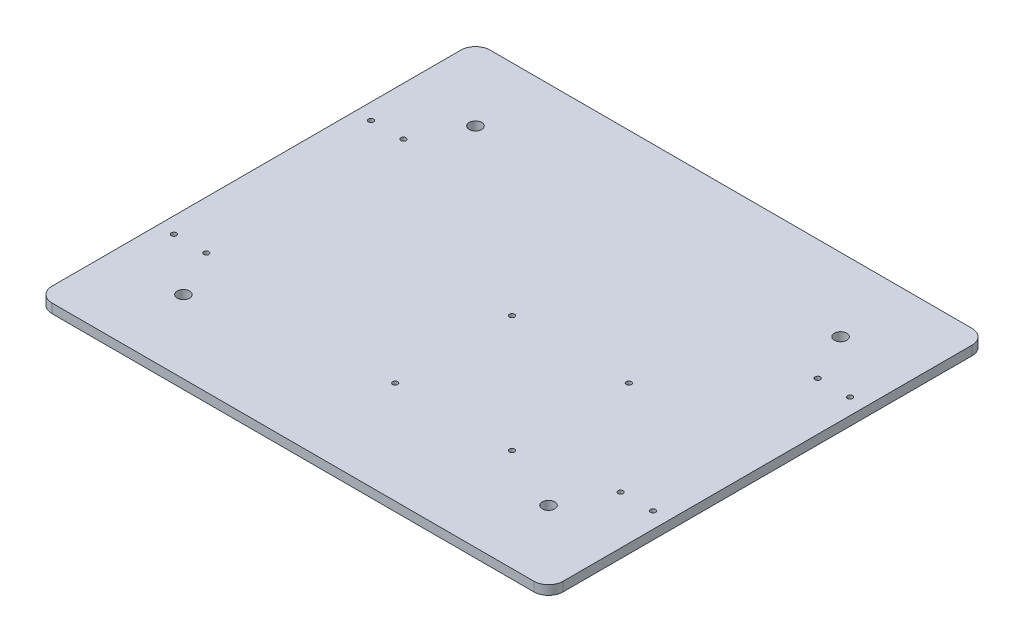
ISO-10303-21;
HEADER;
FILE_DESCRIPTION(('STEP AP214'),'2;1');
FILE_NAME('part.step','',(''),(''),'','','');
FILE_SCHEMA(('AUTOMOTIVE_DESIGN { 1 0 10303 214 1 1 1 1 }'));
ENDSEC;
DATA;
#1=APPLICATION_CONTEXT('core data for automotive mechanical design processes');
#2=APPLICATION_PROTOCOL_DEFINITION('international standard','automotive_design',2000,#1);
#3=PRODUCT_CONTEXT('',#1,'mechanical');
#4=PRODUCT('Part','Part','',(#3));
#5=PRODUCT_RELATED_PRODUCT_CATEGORY('part','',(#4));
#6=PRODUCT_DEFINITION_FORMATION('','',#4);
#7=PRODUCT_DEFINITION_CONTEXT('part definition',#1,'design');
#8=PRODUCT_DEFINITION('design','',#6,#7);
#9=PRODUCT_DEFINITION_SHAPE('','',#8);
#10=(LENGTH_UNIT() NAMED_UNIT(*) SI_UNIT(.MILLI.,.METRE.));
#11=(NAMED_UNIT(*) PLANE_ANGLE_UNIT() SI_UNIT($,.RADIAN.));
#12=(NAMED_UNIT(*) SI_UNIT($,.STERADIAN.) SOLID_ANGLE_UNIT());
#13=UNCERTAINTY_MEASURE_WITH_UNIT(LENGTH_MEASURE(1.E-05),#10,'distance_accuracy_value','');
#14=(GEOMETRIC_REPRESENTATION_CONTEXT(3) GLOBAL_UNCERTAINTY_ASSIGNED_CONTEXT((#13)) GLOBAL_UNIT_ASSIGNED_CONTEXT((#10,
#11,#12)) REPRESENTATION_CONTEXT('',''));
#15=CARTESIAN_POINT('',(0.,0.,0.));
#16=DIRECTION('',(0.,0.,1.));
#17=DIRECTION('',(1.,0.,0.));
#18=AXIS2_PLACEMENT_3D('',#15,#16,#17);
#19=CARTESIAN_POINT('',(-175.,6.35,150.));
#20=DIRECTION('',(1.,0.,0.));
#21=DIRECTION('',(0.,0.,-1.));
#22=AXIS2_PLACEMENT_3D('',#19,#20,#21);
#23=PLANE('',#22);
#24=DIRECTION('',(0.,0.,1.));
#25=VECTOR('',#24,1.);
#26=CARTESIAN_POINT('',(-175.,0.,150.));
#27=LINE('',#26,#25);
#28=CARTESIAN_POINT('',(-175.,0.,-140.));
#29=VERTEX_POINT('',#28);
#30=CARTESIAN_POINT('',(-175.,0.,140.));
#31=VERTEX_POINT('',#30);
#32=EDGE_CURVE('E134',#29,#31,#27,.T.);
#33=ORIENTED_EDGE('',*,*,#32,.T.);
#34=DIRECTION('',(0.,-1.,0.));
#35=VECTOR('',#34,1.);
#36=CARTESIAN_POINT('',(-175.,6.35,140.));
#37=LINE('',#36,#35);
#38=CARTESIAN_POINT('',(-175.,6.35,140.));
#39=VERTEX_POINT('',#38);
#40=EDGE_CURVE('E111',#31,#39,#37,.F.);
#41=ORIENTED_EDGE('',*,*,#40,.T.);
#42=DIRECTION('',(0.,0.,1.));
#43=VECTOR('',#42,1.);
#44=CARTESIAN_POINT('',(-175.,6.35,150.));
#45=LINE('',#44,#43);
#46=CARTESIAN_POINT('',(-175.,6.35,-140.));
#47=VERTEX_POINT('',#46);
#48=EDGE_CURVE('E144',#47,#39,#45,.T.);
#49=ORIENTED_EDGE('',*,*,#48,.F.);
#50=DIRECTION('',(0.,-1.,0.));
#51=VECTOR('',#50,1.);
#52=CARTESIAN_POINT('',(-175.,6.35,-140.));
#53=LINE('',#52,#51);
#54=EDGE_CURVE('E116',#47,#29,#53,.T.);
#55=ORIENTED_EDGE('',*,*,#54,.T.);
#56=EDGE_LOOP('',(#33,#41,#49,#55));
#57=FACE_BOUND('',#56,.T.);
#58=ADVANCED_FACE('F39',(#57),#23,.F.);
#59=CARTESIAN_POINT('',(175.,6.35,150.));
#60=DIRECTION('',(0.,0.,-1.));
#61=DIRECTION('',(-1.,0.,0.));
#62=AXIS2_PLACEMENT_3D('',#59,#60,#61);
#63=PLANE('',#62);
#64=DIRECTION('',(1.,0.,0.));
#65=VECTOR('',#64,1.);
#66=CARTESIAN_POINT('',(175.,6.35,150.));
#67=LINE('',#66,#65);
#68=CARTESIAN_POINT('',(-165.,6.35,150.));
#69=VERTEX_POINT('',#68);
#70=CARTESIAN_POINT('',(165.,6.35,150.));
#71=VERTEX_POINT('',#70);
#72=EDGE_CURVE('E126',#69,#71,#67,.T.);
#73=ORIENTED_EDGE('',*,*,#72,.F.);
#74=DIRECTION('',(0.,-1.,0.));
#75=VECTOR('',#74,1.);
#76=CARTESIAN_POINT('',(-165.,6.35,150.));
#77=LINE('',#76,#75);
#78=CARTESIAN_POINT('',(-165.,0.,150.));
#79=VERTEX_POINT('',#78);
#80=EDGE_CURVE('E110',#69,#79,#77,.T.);
#81=ORIENTED_EDGE('',*,*,#80,.T.);
#82=DIRECTION('',(1.,0.,0.));
#83=VECTOR('',#82,1.);
#84=CARTESIAN_POINT('',(175.,0.,150.));
#85=LINE('',#84,#83);
#86=CARTESIAN_POINT('',(165.,0.,150.));
#87=VERTEX_POINT('',#86);
#88=EDGE_CURVE('E123',#79,#87,#85,.T.);
#89=ORIENTED_EDGE('',*,*,#88,.T.);
#90=DIRECTION('',(0.,-1.,0.));
#91=VECTOR('',#90,1.);
#92=CARTESIAN_POINT('',(165.,6.35,150.));
#93=LINE('',#92,#91);
#94=EDGE_CURVE('E128',#87,#71,#93,.F.);
#95=ORIENTED_EDGE('',*,*,#94,.T.);
#96=EDGE_LOOP('',(#73,#81,#89,#95));
#97=FACE_BOUND('',#96,.T.);
#98=ADVANCED_FACE('F122',(#97),#63,.F.);
#99=CARTESIAN_POINT('',(175.,6.35,150.));
#100=DIRECTION('',(-1.,0.,0.));
#101=DIRECTION('',(0.,0.,1.));
#102=AXIS2_PLACEMENT_3D('',#99,#100,#101);
#103=PLANE('',#102);
#104=DIRECTION('',(0.,0.,-1.));
#105=VECTOR('',#104,1.);
#106=CARTESIAN_POINT('',(175.,6.35,150.));
#107=LINE('',#106,#105);
#108=CARTESIAN_POINT('',(175.,6.35,140.));
#109=VERTEX_POINT('',#108);
#110=CARTESIAN_POINT('',(175.,6.35,-140.));
#111=VERTEX_POINT('',#110);
#112=EDGE_CURVE('E339',#109,#111,#107,.T.);
#113=ORIENTED_EDGE('',*,*,#112,.F.);
#114=DIRECTION('',(0.,-1.,0.));
#115=VECTOR('',#114,1.);
#116=CARTESIAN_POINT('',(175.,6.35,140.));
#117=LINE('',#116,#115);
#118=CARTESIAN_POINT('',(175.,0.,140.));
#119=VERTEX_POINT('',#118);
#120=EDGE_CURVE('E163',#109,#119,#117,.T.);
#121=ORIENTED_EDGE('',*,*,#120,.T.);
#122=DIRECTION('',(0.,0.,-1.));
#123=VECTOR('',#122,1.);
#124=CARTESIAN_POINT('',(175.,0.,150.));
#125=LINE('',#124,#123);
#126=CARTESIAN_POINT('',(175.,0.,-140.));
#127=VERTEX_POINT('',#126);
#128=EDGE_CURVE('E133',#119,#127,#125,.T.);
#129=ORIENTED_EDGE('',*,*,#128,.T.);
#130=DIRECTION('',(0.,-1.,0.));
#131=VECTOR('',#130,1.);
#132=CARTESIAN_POINT('',(175.,6.35,-140.));
#133=LINE('',#132,#131);
#134=EDGE_CURVE('E161',#127,#111,#133,.F.);
#135=ORIENTED_EDGE('',*,*,#134,.T.);
#136=EDGE_LOOP('',(#113,#121,#129,#135));
#137=FACE_BOUND('',#136,.T.);
#138=ADVANCED_FACE('F232',(#137),#103,.F.);
#139=CARTESIAN_POINT('',(175.,6.35,-150.));
#140=DIRECTION('',(0.,0.,1.));
#141=DIRECTION('',(1.,0.,0.));
#142=AXIS2_PLACEMENT_3D('',#139,#140,#141);
#143=PLANE('',#142);
#144=DIRECTION('',(-1.,0.,0.));
#145=VECTOR('',#144,1.);
#146=CARTESIAN_POINT('',(175.,6.35,-150.));
#147=LINE('',#146,#145);
#148=CARTESIAN_POINT('',(165.,6.35,-150.));
#149=VERTEX_POINT('',#148);
#150=CARTESIAN_POINT('',(-165.,6.35,-150.));
#151=VERTEX_POINT('',#150);
#152=EDGE_CURVE('E145',#149,#151,#147,.T.);
#153=ORIENTED_EDGE('',*,*,#152,.F.);
#154=DIRECTION('',(0.,-1.,0.));
#155=VECTOR('',#154,1.);
#156=CARTESIAN_POINT('',(165.,6.35,-150.));
#157=LINE('',#156,#155);
#158=CARTESIAN_POINT('',(165.,0.,-150.));
#159=VERTEX_POINT('',#158);
#160=EDGE_CURVE('E167',#149,#159,#157,.T.);
#161=ORIENTED_EDGE('',*,*,#160,.T.);
#162=DIRECTION('',(-1.,0.,0.));
#163=VECTOR('',#162,1.);
#164=CARTESIAN_POINT('',(175.,0.,-150.));
#165=LINE('',#164,#163);
#166=CARTESIAN_POINT('',(-165.,0.,-150.));
#167=VERTEX_POINT('',#166);
#168=EDGE_CURVE('E137',#159,#167,#165,.T.);
#169=ORIENTED_EDGE('',*,*,#168,.T.);
#170=DIRECTION('',(0.,-1.,0.));
#171=VECTOR('',#170,1.);
#172=CARTESIAN_POINT('',(-165.,6.35,-150.));
#173=LINE('',#172,#171);
#174=EDGE_CURVE('E54',#167,#151,#173,.F.);
#175=ORIENTED_EDGE('',*,*,#174,.T.);
#176=EDGE_LOOP('',(#153,#161,#169,#175));
#177=FACE_BOUND('',#176,.T.);
#178=ADVANCED_FACE('F220',(#177),#143,.F.);
#179=CARTESIAN_POINT('',(0.,6.35,0.));
#180=DIRECTION('',(0.,1.,0.));
#181=DIRECTION('',(0.,0.,1.));
#182=AXIS2_PLACEMENT_3D('',#179,#180,#181);
#183=PLANE('',#182);
#184=CARTESIAN_POINT('',(164.05,6.35,-67.5));
#185=DIRECTION('',(0.,-1.,0.));
#186=DIRECTION('',(0.,0.,-1.));
#187=AXIS2_PLACEMENT_3D('',#184,#185,#186);
#188=CIRCLE('',#187,1.75000000000001);
#189=CARTESIAN_POINT('',(164.05,6.35,-69.25));
#190=VERTEX_POINT('',#189);
#191=EDGE_CURVE('E567',#190,#190,#188,.T.);
#192=ORIENTED_EDGE('',*,*,#191,.T.);
#193=EDGE_LOOP('',(#192));
#194=FACE_BOUND('',#193,.T.);
#195=CARTESIAN_POINT('',(141.82,6.35,-67.5));
#196=DIRECTION('',(0.,-1.,0.));
#197=DIRECTION('',(0.,0.,-1.));
#198=AXIS2_PLACEMENT_3D('',#195,#196,#197);
#199=CIRCLE('',#198,1.75000000000001);
#200=CARTESIAN_POINT('',(141.82,6.35,-69.25));
#201=VERTEX_POINT('',#200);
#202=EDGE_CURVE('E558',#201,#201,#199,.T.);
#203=ORIENTED_EDGE('',*,*,#202,.T.);
#204=EDGE_LOOP('',(#203));
#205=FACE_BOUND('',#204,.T.);
#206=CARTESIAN_POINT('',(-164.05,6.35,-67.5));
#207=DIRECTION('',(0.,-1.,0.));
#208=DIRECTION('',(0.,0.,-1.));
#209=AXIS2_PLACEMENT_3D('',#206,#207,#208);
#210=CIRCLE('',#209,1.75000000000001);
#211=CARTESIAN_POINT('',(-164.05,6.35,-69.25));
#212=VERTEX_POINT('',#211);
#213=EDGE_CURVE('E555',#212,#212,#210,.T.);
#214=ORIENTED_EDGE('',*,*,#213,.T.);
#215=EDGE_LOOP('',(#214));
#216=FACE_BOUND('',#215,.T.);
#217=CARTESIAN_POINT('',(-141.82,6.35,-67.5));
#218=DIRECTION('',(0.,-1.,0.));
#219=DIRECTION('',(0.,0.,-1.));
#220=AXIS2_PLACEMENT_3D('',#217,#218,#219);
#221=CIRCLE('',#220,1.75000000000001);
#222=CARTESIAN_POINT('',(-141.82,6.35,-69.25));
#223=VERTEX_POINT('',#222);
#224=EDGE_CURVE('E546',#223,#223,#221,.T.);
#225=ORIENTED_EDGE('',*,*,#224,.T.);
#226=EDGE_LOOP('',(#225));
#227=FACE_BOUND('',#226,.T.);
#228=CARTESIAN_POINT('',(80.,6.35,0.));
#229=DIRECTION('',(0.,-1.,0.));
#230=DIRECTION('',(0.,0.,-1.));
#231=AXIS2_PLACEMENT_3D('',#228,#229,#230);
#232=CIRCLE('',#231,1.75);
#233=CARTESIAN_POINT('',(80.,6.35,-1.75));
#234=VERTEX_POINT('',#233);
#235=EDGE_CURVE('E543',#234,#234,#232,.T.);
#236=ORIENTED_EDGE('',*,*,#235,.T.);
#237=EDGE_LOOP('',(#236));
#238=FACE_BOUND('',#237,.T.);
#239=CARTESIAN_POINT('',(0.,6.35,0.));
#240=DIRECTION('',(0.,-1.,0.));
#241=DIRECTION('',(0.,0.,-1.));
#242=AXIS2_PLACEMENT_3D('',#239,#240,#241);
#243=CIRCLE('',#242,1.75);
#244=CARTESIAN_POINT('',(0.,6.35,-1.75));
#245=VERTEX_POINT('',#244);
#246=EDGE_CURVE('E532',#245,#245,#243,.T.);
#247=ORIENTED_EDGE('',*,*,#246,.T.);
#248=EDGE_LOOP('',(#247));
#249=FACE_BOUND('',#248,.T.);
#250=CARTESIAN_POINT('',(125.,6.35,100.));
#251=DIRECTION('',(0.,-1.,0.));
#252=DIRECTION('',(0.,0.,-1.));
#253=AXIS2_PLACEMENT_3D('',#250,#251,#252);
#254=CIRCLE('',#253,4.25000000000001);
#255=CARTESIAN_POINT('',(125.,6.35,95.75));
#256=VERTEX_POINT('',#255);
#257=EDGE_CURVE('E527',#256,#256,#254,.T.);
#258=ORIENTED_EDGE('',*,*,#257,.T.);
#259=EDGE_LOOP('',(#258));
#260=FACE_BOUND('',#259,.T.);
#261=CARTESIAN_POINT('',(125.,6.35,-100.));
#262=DIRECTION('',(0.,-1.,0.));
#263=DIRECTION('',(0.,0.,-1.));
#264=AXIS2_PLACEMENT_3D('',#261,#262,#263);
#265=CIRCLE('',#264,4.25000000000001);
#266=CARTESIAN_POINT('',(125.,6.35,-104.25));
#267=VERTEX_POINT('',#266);
#268=EDGE_CURVE('E323',#267,#267,#265,.T.);
#269=ORIENTED_EDGE('',*,*,#268,.T.);
#270=EDGE_LOOP('',(#269));
#271=FACE_BOUND('',#270,.T.);
#272=CARTESIAN_POINT('',(-125.,6.35,100.));
#273=DIRECTION('',(0.,-1.,0.));
#274=DIRECTION('',(0.,0.,-1.));
#275=AXIS2_PLACEMENT_3D('',#272,#273,#274);
#276=CIRCLE('',#275,4.25000000000001);
#277=CARTESIAN_POINT('',(-125.,6.35,95.75));
#278=VERTEX_POINT('',#277);
#279=EDGE_CURVE('E318',#278,#278,#276,.T.);
#280=ORIENTED_EDGE('',*,*,#279,.T.);
#281=EDGE_LOOP('',(#280));
#282=FACE_BOUND('',#281,.T.);
#283=CARTESIAN_POINT('',(-125.,6.35,-100.));
#284=DIRECTION('',(0.,-1.,0.));
#285=DIRECTION('',(0.,0.,-1.));
#286=AXIS2_PLACEMENT_3D('',#283,#284,#285);
#287=CIRCLE('',#286,4.25000000000001);
#288=CARTESIAN_POINT('',(-125.,6.35,-104.25));
#289=VERTEX_POINT('',#288);
#290=EDGE_CURVE('E139',#289,#289,#287,.T.);
#291=ORIENTED_EDGE('',*,*,#290,.T.);
#292=EDGE_LOOP('',(#291));
#293=FACE_BOUND('',#292,.T.);
#294=ORIENTED_EDGE('',*,*,#48,.T.);
#295=CARTESIAN_POINT('',(-165.,6.35,140.));
#296=DIRECTION('',(0.,1.,0.));
#297=DIRECTION('',(0.,0.,1.));
#298=AXIS2_PLACEMENT_3D('',#295,#296,#297);
#299=CIRCLE('',#298,10.);
#300=EDGE_CURVE('E159',#39,#69,#299,.T.);
#301=ORIENTED_EDGE('',*,*,#300,.T.);
#302=ORIENTED_EDGE('',*,*,#72,.T.);
#303=CARTESIAN_POINT('',(165.,6.35,140.));
#304=DIRECTION('',(0.,1.,0.));
#305=DIRECTION('',(0.,0.,1.));
#306=AXIS2_PLACEMENT_3D('',#303,#304,#305);
#307=CIRCLE('',#306,10.);
#308=EDGE_CURVE('E157',#71,#109,#307,.T.);
#309=ORIENTED_EDGE('',*,*,#308,.T.);
#310=ORIENTED_EDGE('',*,*,#112,.T.);
#311=CARTESIAN_POINT('',(165.,6.35,-140.));
#312=DIRECTION('',(0.,1.,0.));
#313=DIRECTION('',(0.,0.,1.));
#314=AXIS2_PLACEMENT_3D('',#311,#312,#313);
#315=CIRCLE('',#314,10.);
#316=EDGE_CURVE('E61',#111,#149,#315,.T.);
#317=ORIENTED_EDGE('',*,*,#316,.T.);
#318=ORIENTED_EDGE('',*,*,#152,.T.);
#319=CARTESIAN_POINT('',(-165.,6.35,-140.));
#320=DIRECTION('',(0.,1.,0.));
#321=DIRECTION('',(0.,0.,1.));
#322=AXIS2_PLACEMENT_3D('',#319,#320,#321);
#323=CIRCLE('',#322,10.);
#324=EDGE_CURVE('E154',#151,#47,#323,.T.);
#325=ORIENTED_EDGE('',*,*,#324,.T.);
#326=EDGE_LOOP('',(#294,#301,#302,#309,#310,#317,#318,#325));
#327=FACE_BOUND('',#326,.T.);
#328=CARTESIAN_POINT('',(0.,6.35,80.));
#329=DIRECTION('',(0.,-1.,0.));
#330=DIRECTION('',(0.,0.,-1.));
#331=AXIS2_PLACEMENT_3D('',#328,#329,#330);
#332=CIRCLE('',#331,1.75);
#333=CARTESIAN_POINT('',(0.,6.35,78.25));
#334=VERTEX_POINT('',#333);
#335=EDGE_CURVE('E170',#334,#334,#332,.T.);
#336=ORIENTED_EDGE('',*,*,#335,.T.);
#337=EDGE_LOOP('',(#336));
#338=FACE_BOUND('',#337,.T.);
#339=CARTESIAN_POINT('',(80.,6.35,80.));
#340=DIRECTION('',(0.,-1.,0.));
#341=DIRECTION('',(0.,0.,-1.));
#342=AXIS2_PLACEMENT_3D('',#339,#340,#341);
#343=CIRCLE('',#342,1.75);
#344=CARTESIAN_POINT('',(80.,6.35,78.25));
#345=VERTEX_POINT('',#344);
#346=EDGE_CURVE('E176',#345,#345,#343,.T.);
#347=ORIENTED_EDGE('',*,*,#346,.T.);
#348=EDGE_LOOP('',(#347));
#349=FACE_BOUND('',#348,.T.);
#350=CARTESIAN_POINT('',(-141.82,6.35,67.5));
#351=DIRECTION('',(0.,-1.,0.));
#352=DIRECTION('',(0.,0.,-1.));
#353=AXIS2_PLACEMENT_3D('',#350,#351,#352);
#354=CIRCLE('',#353,1.75000000000001);
#355=CARTESIAN_POINT('',(-141.82,6.35,65.75));
#356=VERTEX_POINT('',#355);
#357=EDGE_CURVE('E182',#356,#356,#354,.T.);
#358=ORIENTED_EDGE('',*,*,#357,.T.);
#359=EDGE_LOOP('',(#358));
#360=FACE_BOUND('',#359,.T.);
#361=CARTESIAN_POINT('',(-164.05,6.35,67.5));
#362=DIRECTION('',(0.,-1.,0.));
#363=DIRECTION('',(0.,0.,-1.));
#364=AXIS2_PLACEMENT_3D('',#361,#362,#363);
#365=CIRCLE('',#364,1.75000000000001);
#366=CARTESIAN_POINT('',(-164.05,6.35,65.75));
#367=VERTEX_POINT('',#366);
#368=EDGE_CURVE('E188',#367,#367,#365,.T.);
#369=ORIENTED_EDGE('',*,*,#368,.T.);
#370=EDGE_LOOP('',(#369));
#371=FACE_BOUND('',#370,.T.);
#372=CARTESIAN_POINT('',(141.82,6.35,67.5));
#373=DIRECTION('',(0.,-1.,0.));
#374=DIRECTION('',(0.,0.,-1.));
#375=AXIS2_PLACEMENT_3D('',#372,#373,#374);
#376=CIRCLE('',#375,1.75000000000001);
#377=CARTESIAN_POINT('',(141.82,6.35,65.75));
#378=VERTEX_POINT('',#377);
#379=EDGE_CURVE('E194',#378,#378,#376,.T.);
#380=ORIENTED_EDGE('',*,*,#379,.T.);
#381=EDGE_LOOP('',(#380));
#382=FACE_BOUND('',#381,.T.);
#383=CARTESIAN_POINT('',(164.05,6.35,67.5));
#384=DIRECTION('',(0.,-1.,0.));
#385=DIRECTION('',(0.,0.,-1.));
#386=AXIS2_PLACEMENT_3D('',#383,#384,#385);
#387=CIRCLE('',#386,1.75000000000001);
#388=CARTESIAN_POINT('',(164.05,6.35,65.75));
#389=VERTEX_POINT('',#388);
#390=EDGE_CURVE('E47',#389,#389,#387,.T.);
#391=ORIENTED_EDGE('',*,*,#390,.T.);
#392=EDGE_LOOP('',(#391));
#393=FACE_BOUND('',#392,.T.);
#394=ADVANCED_FACE('F202',(#194,#205,#216,#227,#238,#249,#260,#271,#282,#293,#327,#338,#349,
#360,#371,#382,#393),#183,.T.);
#395=CARTESIAN_POINT('',(0.,0.,0.));
#396=DIRECTION('',(0.,1.,0.));
#397=DIRECTION('',(0.,0.,1.));
#398=AXIS2_PLACEMENT_3D('',#395,#396,#397);
#399=PLANE('',#398);
#400=CARTESIAN_POINT('',(164.05,0.,-67.5));
#401=DIRECTION('',(0.,-1.,0.));
#402=DIRECTION('',(0.,0.,-1.));
#403=AXIS2_PLACEMENT_3D('',#400,#401,#402);
#404=CIRCLE('',#403,1.75000000000001);
#405=CARTESIAN_POINT('',(164.05,0.,-69.25));
#406=VERTEX_POINT('',#405);
#407=EDGE_CURVE('E562',#406,#406,#404,.T.);
#408=ORIENTED_EDGE('',*,*,#407,.F.);
#409=EDGE_LOOP('',(#408));
#410=FACE_BOUND('',#409,.T.);
#411=CARTESIAN_POINT('',(141.82,0.,-67.5));
#412=DIRECTION('',(0.,-1.,0.));
#413=DIRECTION('',(0.,0.,-1.));
#414=AXIS2_PLACEMENT_3D('',#411,#412,#413);
#415=CIRCLE('',#414,1.75000000000001);
#416=CARTESIAN_POINT('',(141.82,0.,-69.25));
#417=VERTEX_POINT('',#416);
#418=EDGE_CURVE('E559',#417,#417,#415,.T.);
#419=ORIENTED_EDGE('',*,*,#418,.F.);
#420=EDGE_LOOP('',(#419));
#421=FACE_BOUND('',#420,.T.);
#422=CARTESIAN_POINT('',(-164.05,0.,-67.5));
#423=DIRECTION('',(0.,-1.,0.));
#424=DIRECTION('',(0.,0.,-1.));
#425=AXIS2_PLACEMENT_3D('',#422,#423,#424);
#426=CIRCLE('',#425,1.75000000000001);
#427=CARTESIAN_POINT('',(-164.05,0.,-69.25));
#428=VERTEX_POINT('',#427);
#429=EDGE_CURVE('E550',#428,#428,#426,.T.);
#430=ORIENTED_EDGE('',*,*,#429,.F.);
#431=EDGE_LOOP('',(#430));
#432=FACE_BOUND('',#431,.T.);
#433=CARTESIAN_POINT('',(-141.82,0.,-67.5));
#434=DIRECTION('',(0.,-1.,0.));
#435=DIRECTION('',(0.,0.,-1.));
#436=AXIS2_PLACEMENT_3D('',#433,#434,#435);
#437=CIRCLE('',#436,1.75000000000001);
#438=CARTESIAN_POINT('',(-141.82,0.,-69.25));
#439=VERTEX_POINT('',#438);
#440=EDGE_CURVE('E547',#439,#439,#437,.T.);
#441=ORIENTED_EDGE('',*,*,#440,.F.);
#442=EDGE_LOOP('',(#441));
#443=FACE_BOUND('',#442,.T.);
#444=CARTESIAN_POINT('',(80.,0.,0.));
#445=DIRECTION('',(0.,-1.,0.));
#446=DIRECTION('',(0.,0.,-1.));
#447=AXIS2_PLACEMENT_3D('',#444,#445,#446);
#448=CIRCLE('',#447,1.75);
#449=CARTESIAN_POINT('',(80.,0.,-1.75));
#450=VERTEX_POINT('',#449);
#451=EDGE_CURVE('E538',#450,#450,#448,.T.);
#452=ORIENTED_EDGE('',*,*,#451,.F.);
#453=EDGE_LOOP('',(#452));
#454=FACE_BOUND('',#453,.T.);
#455=CARTESIAN_POINT('',(0.,0.,0.));
#456=DIRECTION('',(0.,-1.,0.));
#457=DIRECTION('',(0.,0.,-1.));
#458=AXIS2_PLACEMENT_3D('',#455,#456,#457);
#459=CIRCLE('',#458,1.75);
#460=CARTESIAN_POINT('',(0.,0.,-1.75));
#461=VERTEX_POINT('',#460);
#462=EDGE_CURVE('E535',#461,#461,#459,.T.);
#463=ORIENTED_EDGE('',*,*,#462,.F.);
#464=EDGE_LOOP('',(#463));
#465=FACE_BOUND('',#464,.T.);
#466=CARTESIAN_POINT('',(125.,0.,100.));
#467=DIRECTION('',(0.,-1.,0.));
#468=DIRECTION('',(0.,0.,-1.));
#469=AXIS2_PLACEMENT_3D('',#466,#467,#468);
#470=CIRCLE('',#469,4.25000000000001);
#471=CARTESIAN_POINT('',(125.,0.,95.75));
#472=VERTEX_POINT('',#471);
#473=EDGE_CURVE('E529',#472,#472,#470,.T.);
#474=ORIENTED_EDGE('',*,*,#473,.F.);
#475=EDGE_LOOP('',(#474));
#476=FACE_BOUND('',#475,.T.);
#477=CARTESIAN_POINT('',(125.,0.,-100.));
#478=DIRECTION('',(0.,-1.,0.));
#479=DIRECTION('',(0.,0.,-1.));
#480=AXIS2_PLACEMENT_3D('',#477,#478,#479);
#481=CIRCLE('',#480,4.25000000000001);
#482=CARTESIAN_POINT('',(125.,0.,-104.25));
#483=VERTEX_POINT('',#482);
#484=EDGE_CURVE('E328',#483,#483,#481,.T.);
#485=ORIENTED_EDGE('',*,*,#484,.F.);
#486=EDGE_LOOP('',(#485));
#487=FACE_BOUND('',#486,.T.);
#488=CARTESIAN_POINT('',(-125.,0.,100.));
#489=DIRECTION('',(0.,-1.,0.));
#490=DIRECTION('',(0.,0.,-1.));
#491=AXIS2_PLACEMENT_3D('',#488,#489,#490);
#492=CIRCLE('',#491,4.25000000000001);
#493=CARTESIAN_POINT('',(-125.,0.,95.75));
#494=VERTEX_POINT('',#493);
#495=EDGE_CURVE('E321',#494,#494,#492,.T.);
#496=ORIENTED_EDGE('',*,*,#495,.F.);
#497=EDGE_LOOP('',(#496));
#498=FACE_BOUND('',#497,.T.);
#499=CARTESIAN_POINT('',(-125.,0.,-100.));
#500=DIRECTION('',(0.,-1.,0.));
#501=DIRECTION('',(0.,0.,-1.));
#502=AXIS2_PLACEMENT_3D('',#499,#500,#501);
#503=CIRCLE('',#502,4.25000000000001);
#504=CARTESIAN_POINT('',(-125.,0.,-104.25));
#505=VERTEX_POINT('',#504);
#506=EDGE_CURVE('E325',#505,#505,#503,.T.);
#507=ORIENTED_EDGE('',*,*,#506,.F.);
#508=EDGE_LOOP('',(#507));
#509=FACE_BOUND('',#508,.T.);
#510=ORIENTED_EDGE('',*,*,#88,.F.);
#511=CARTESIAN_POINT('',(-165.,0.,140.));
#512=DIRECTION('',(0.,1.,0.));
#513=DIRECTION('',(0.,0.,1.));
#514=AXIS2_PLACEMENT_3D('',#511,#512,#513);
#515=CIRCLE('',#514,10.);
#516=EDGE_CURVE('E106',#79,#31,#515,.F.);
#517=ORIENTED_EDGE('',*,*,#516,.T.);
#518=ORIENTED_EDGE('',*,*,#32,.F.);
#519=CARTESIAN_POINT('',(-165.,0.,-140.));
#520=DIRECTION('',(0.,1.,0.));
#521=DIRECTION('',(0.,0.,1.));
#522=AXIS2_PLACEMENT_3D('',#519,#520,#521);
#523=CIRCLE('',#522,10.);
#524=EDGE_CURVE('E127',#29,#167,#523,.F.);
#525=ORIENTED_EDGE('',*,*,#524,.T.);
#526=ORIENTED_EDGE('',*,*,#168,.F.);
#527=CARTESIAN_POINT('',(165.,0.,-140.));
#528=DIRECTION('',(0.,1.,0.));
#529=DIRECTION('',(0.,0.,1.));
#530=AXIS2_PLACEMENT_3D('',#527,#528,#529);
#531=CIRCLE('',#530,10.);
#532=EDGE_CURVE('E148',#159,#127,#531,.F.);
#533=ORIENTED_EDGE('',*,*,#532,.T.);
#534=ORIENTED_EDGE('',*,*,#128,.F.);
#535=CARTESIAN_POINT('',(165.,0.,140.));
#536=DIRECTION('',(0.,1.,0.));
#537=DIRECTION('',(0.,0.,1.));
#538=AXIS2_PLACEMENT_3D('',#535,#536,#537);
#539=CIRCLE('',#538,10.);
#540=EDGE_CURVE('E117',#119,#87,#539,.F.);
#541=ORIENTED_EDGE('',*,*,#540,.T.);
#542=EDGE_LOOP('',(#510,#517,#518,#525,#526,#533,#534,#541));
#543=FACE_BOUND('',#542,.T.);
#544=CARTESIAN_POINT('',(0.,0.,80.));
#545=DIRECTION('',(0.,-1.,0.));
#546=DIRECTION('',(0.,0.,-1.));
#547=AXIS2_PLACEMENT_3D('',#544,#545,#546);
#548=CIRCLE('',#547,1.75);
#549=CARTESIAN_POINT('',(0.,0.,78.25));
#550=VERTEX_POINT('',#549);
#551=EDGE_CURVE('E173',#550,#550,#548,.T.);
#552=ORIENTED_EDGE('',*,*,#551,.F.);
#553=EDGE_LOOP('',(#552));
#554=FACE_BOUND('',#553,.T.);
#555=CARTESIAN_POINT('',(80.,0.,80.));
#556=DIRECTION('',(0.,-1.,0.));
#557=DIRECTION('',(0.,0.,-1.));
#558=AXIS2_PLACEMENT_3D('',#555,#556,#557);
#559=CIRCLE('',#558,1.75);
#560=CARTESIAN_POINT('',(80.,0.,78.25));
#561=VERTEX_POINT('',#560);
#562=EDGE_CURVE('E179',#561,#561,#559,.T.);
#563=ORIENTED_EDGE('',*,*,#562,.F.);
#564=EDGE_LOOP('',(#563));
#565=FACE_BOUND('',#564,.T.);
#566=CARTESIAN_POINT('',(-141.82,0.,67.5));
#567=DIRECTION('',(0.,-1.,0.));
#568=DIRECTION('',(0.,0.,-1.));
#569=AXIS2_PLACEMENT_3D('',#566,#567,#568);
#570=CIRCLE('',#569,1.75000000000001);
#571=CARTESIAN_POINT('',(-141.82,0.,65.75));
#572=VERTEX_POINT('',#571);
#573=EDGE_CURVE('E185',#572,#572,#570,.T.);
#574=ORIENTED_EDGE('',*,*,#573,.F.);
#575=EDGE_LOOP('',(#574));
#576=FACE_BOUND('',#575,.T.);
#577=CARTESIAN_POINT('',(-164.05,0.,67.5));
#578=DIRECTION('',(0.,-1.,0.));
#579=DIRECTION('',(0.,0.,-1.));
#580=AXIS2_PLACEMENT_3D('',#577,#578,#579);
#581=CIRCLE('',#580,1.75000000000001);
#582=CARTESIAN_POINT('',(-164.05,0.,65.75));
#583=VERTEX_POINT('',#582);
#584=EDGE_CURVE('E191',#583,#583,#581,.T.);
#585=ORIENTED_EDGE('',*,*,#584,.F.);
#586=EDGE_LOOP('',(#585));
#587=FACE_BOUND('',#586,.T.);
#588=CARTESIAN_POINT('',(141.82,0.,67.5));
#589=DIRECTION('',(0.,-1.,0.));
#590=DIRECTION('',(0.,0.,-1.));
#591=AXIS2_PLACEMENT_3D('',#588,#589,#590);
#592=CIRCLE('',#591,1.75000000000001);
#593=CARTESIAN_POINT('',(141.82,0.,65.75));
#594=VERTEX_POINT('',#593);
#595=EDGE_CURVE('E197',#594,#594,#592,.T.);
#596=ORIENTED_EDGE('',*,*,#595,.F.);
#597=EDGE_LOOP('',(#596));
#598=FACE_BOUND('',#597,.T.);
#599=CARTESIAN_POINT('',(164.05,0.,67.5));
#600=DIRECTION('',(0.,-1.,0.));
#601=DIRECTION('',(0.,0.,-1.));
#602=AXIS2_PLACEMENT_3D('',#599,#600,#601);
#603=CIRCLE('',#602,1.75000000000001);
#604=CARTESIAN_POINT('',(164.05,0.,65.75));
#605=VERTEX_POINT('',#604);
#606=EDGE_CURVE('E11',#605,#605,#603,.T.);
#607=ORIENTED_EDGE('',*,*,#606,.F.);
#608=EDGE_LOOP('',(#607));
#609=FACE_BOUND('',#608,.T.);
#610=ADVANCED_FACE('F130',(#410,#421,#432,#443,#454,#465,#476,#487,#498,#509,#543,#554,#565,
#576,#587,#598,#609),#399,.F.);
#611=CARTESIAN_POINT('',(-125.,6.35,-100.));
#612=DIRECTION('',(0.,-1.,0.));
#613=DIRECTION('',(0.,0.,-1.));
#614=AXIS2_PLACEMENT_3D('',#611,#612,#613);
#615=CYLINDRICAL_SURFACE('',#614,4.25000000000001);
#616=ORIENTED_EDGE('',*,*,#290,.F.);
#617=EDGE_LOOP('',(#616));
#618=FACE_BOUND('',#617,.T.);
#619=ORIENTED_EDGE('',*,*,#506,.T.);
#620=EDGE_LOOP('',(#619));
#621=FACE_BOUND('',#620,.T.);
#622=ADVANCED_FACE('F210',(#618,#621),#615,.F.);
#623=CARTESIAN_POINT('',(-125.,6.35,100.));
#624=DIRECTION('',(0.,-1.,0.));
#625=DIRECTION('',(0.,0.,-1.));
#626=AXIS2_PLACEMENT_3D('',#623,#624,#625);
#627=CYLINDRICAL_SURFACE('',#626,4.25000000000001);
#628=ORIENTED_EDGE('',*,*,#279,.F.);
#629=EDGE_LOOP('',(#628));
#630=FACE_BOUND('',#629,.T.);
#631=ORIENTED_EDGE('',*,*,#495,.T.);
#632=EDGE_LOOP('',(#631));
#633=FACE_BOUND('',#632,.T.);
#634=ADVANCED_FACE('F217',(#630,#633),#627,.F.);
#635=CARTESIAN_POINT('',(125.,6.35,-100.));
#636=DIRECTION('',(0.,-1.,0.));
#637=DIRECTION('',(0.,0.,-1.));
#638=AXIS2_PLACEMENT_3D('',#635,#636,#637);
#639=CYLINDRICAL_SURFACE('',#638,4.25000000000001);
#640=ORIENTED_EDGE('',*,*,#268,.F.);
#641=EDGE_LOOP('',(#640));
#642=FACE_BOUND('',#641,.T.);
#643=ORIENTED_EDGE('',*,*,#484,.T.);
#644=EDGE_LOOP('',(#643));
#645=FACE_BOUND('',#644,.T.);
#646=ADVANCED_FACE('F306',(#642,#645),#639,.F.);
#647=CARTESIAN_POINT('',(125.,6.35,100.));
#648=DIRECTION('',(0.,-1.,0.));
#649=DIRECTION('',(0.,0.,-1.));
#650=AXIS2_PLACEMENT_3D('',#647,#648,#649);
#651=CYLINDRICAL_SURFACE('',#650,4.25000000000001);
#652=ORIENTED_EDGE('',*,*,#257,.F.);
#653=EDGE_LOOP('',(#652));
#654=FACE_BOUND('',#653,.T.);
#655=ORIENTED_EDGE('',*,*,#473,.T.);
#656=EDGE_LOOP('',(#655));
#657=FACE_BOUND('',#656,.T.);
#658=ADVANCED_FACE('F239',(#654,#657),#651,.F.);
#659=CARTESIAN_POINT('',(-165.,6.35,140.));
#660=DIRECTION('',(0.,-1.,0.));
#661=DIRECTION('',(0.,0.,-1.));
#662=AXIS2_PLACEMENT_3D('',#659,#660,#661);
#663=CYLINDRICAL_SURFACE('',#662,10.);
#664=ORIENTED_EDGE('',*,*,#300,.F.);
#665=ORIENTED_EDGE('',*,*,#40,.F.);
#666=ORIENTED_EDGE('',*,*,#516,.F.);
#667=ORIENTED_EDGE('',*,*,#80,.F.);
#668=EDGE_LOOP('',(#664,#665,#666,#667));
#669=FACE_BOUND('',#668,.T.);
#670=ADVANCED_FACE('F109',(#669),#663,.T.);
#671=CARTESIAN_POINT('',(165.,6.35,140.));
#672=DIRECTION('',(0.,-1.,0.));
#673=DIRECTION('',(0.,0.,-1.));
#674=AXIS2_PLACEMENT_3D('',#671,#672,#673);
#675=CYLINDRICAL_SURFACE('',#674,10.);
#676=ORIENTED_EDGE('',*,*,#308,.F.);
#677=ORIENTED_EDGE('',*,*,#94,.F.);
#678=ORIENTED_EDGE('',*,*,#540,.F.);
#679=ORIENTED_EDGE('',*,*,#120,.F.);
#680=EDGE_LOOP('',(#676,#677,#678,#679));
#681=FACE_BOUND('',#680,.T.);
#682=ADVANCED_FACE('F238',(#681),#675,.T.);
#683=CARTESIAN_POINT('',(165.,6.35,-140.));
#684=DIRECTION('',(0.,-1.,0.));
#685=DIRECTION('',(0.,0.,-1.));
#686=AXIS2_PLACEMENT_3D('',#683,#684,#685);
#687=CYLINDRICAL_SURFACE('',#686,10.);
#688=ORIENTED_EDGE('',*,*,#316,.F.);
#689=ORIENTED_EDGE('',*,*,#134,.F.);
#690=ORIENTED_EDGE('',*,*,#532,.F.);
#691=ORIENTED_EDGE('',*,*,#160,.F.);
#692=EDGE_LOOP('',(#688,#689,#690,#691));
#693=FACE_BOUND('',#692,.T.);
#694=ADVANCED_FACE('F242',(#693),#687,.T.);
#695=CARTESIAN_POINT('',(-165.,6.35,-140.));
#696=DIRECTION('',(0.,-1.,0.));
#697=DIRECTION('',(0.,0.,-1.));
#698=AXIS2_PLACEMENT_3D('',#695,#696,#697);
#699=CYLINDRICAL_SURFACE('',#698,10.);
#700=ORIENTED_EDGE('',*,*,#324,.F.);
#701=ORIENTED_EDGE('',*,*,#174,.F.);
#702=ORIENTED_EDGE('',*,*,#524,.F.);
#703=ORIENTED_EDGE('',*,*,#54,.F.);
#704=EDGE_LOOP('',(#700,#701,#702,#703));
#705=FACE_BOUND('',#704,.T.);
#706=ADVANCED_FACE('F246',(#705),#699,.T.);
#707=CARTESIAN_POINT('',(0.,6.35,0.));
#708=DIRECTION('',(0.,-1.,0.));
#709=DIRECTION('',(0.,0.,-1.));
#710=AXIS2_PLACEMENT_3D('',#707,#708,#709);
#711=CYLINDRICAL_SURFACE('',#710,1.75);
#712=ORIENTED_EDGE('',*,*,#246,.F.);
#713=EDGE_LOOP('',(#712));
#714=FACE_BOUND('',#713,.T.);
#715=ORIENTED_EDGE('',*,*,#462,.T.);
#716=EDGE_LOOP('',(#715));
#717=FACE_BOUND('',#716,.T.);
#718=ADVANCED_FACE('F250',(#714,#717),#711,.F.);
#719=CARTESIAN_POINT('',(80.,6.35,0.));
#720=DIRECTION('',(0.,-1.,0.));
#721=DIRECTION('',(0.,0.,-1.));
#722=AXIS2_PLACEMENT_3D('',#719,#720,#721);
#723=CYLINDRICAL_SURFACE('',#722,1.75);
#724=ORIENTED_EDGE('',*,*,#235,.F.);
#725=EDGE_LOOP('',(#724));
#726=FACE_BOUND('',#725,.T.);
#727=ORIENTED_EDGE('',*,*,#451,.T.);
#728=EDGE_LOOP('',(#727));
#729=FACE_BOUND('',#728,.T.);
#730=ADVANCED_FACE('F256',(#726,#729),#723,.F.);
#731=CARTESIAN_POINT('',(0.,6.35,80.));
#732=DIRECTION('',(0.,-1.,0.));
#733=DIRECTION('',(0.,0.,-1.));
#734=AXIS2_PLACEMENT_3D('',#731,#732,#733);
#735=CYLINDRICAL_SURFACE('',#734,1.75);
#736=ORIENTED_EDGE('',*,*,#335,.F.);
#737=EDGE_LOOP('',(#736));
#738=FACE_BOUND('',#737,.T.);
#739=ORIENTED_EDGE('',*,*,#551,.T.);
#740=EDGE_LOOP('',(#739));
#741=FACE_BOUND('',#740,.T.);
#742=ADVANCED_FACE('F252',(#738,#741),#735,.F.);
#743=CARTESIAN_POINT('',(80.,6.35,80.));
#744=DIRECTION('',(0.,-1.,0.));
#745=DIRECTION('',(0.,0.,-1.));
#746=AXIS2_PLACEMENT_3D('',#743,#744,#745);
#747=CYLINDRICAL_SURFACE('',#746,1.75);
#748=ORIENTED_EDGE('',*,*,#346,.F.);
#749=EDGE_LOOP('',(#748));
#750=FACE_BOUND('',#749,.T.);
#751=ORIENTED_EDGE('',*,*,#562,.T.);
#752=EDGE_LOOP('',(#751));
#753=FACE_BOUND('',#752,.T.);
#754=ADVANCED_FACE('F255',(#750,#753),#747,.F.);
#755=CARTESIAN_POINT('',(-141.82,6.35,-67.5));
#756=DIRECTION('',(0.,-1.,0.));
#757=DIRECTION('',(0.,0.,-1.));
#758=AXIS2_PLACEMENT_3D('',#755,#756,#757);
#759=CYLINDRICAL_SURFACE('',#758,1.75000000000001);
#760=ORIENTED_EDGE('',*,*,#224,.F.);
#761=EDGE_LOOP('',(#760));
#762=FACE_BOUND('',#761,.T.);
#763=ORIENTED_EDGE('',*,*,#440,.T.);
#764=EDGE_LOOP('',(#763));
#765=FACE_BOUND('',#764,.T.);
#766=ADVANCED_FACE('F260',(#762,#765),#759,.F.);
#767=CARTESIAN_POINT('',(-164.05,6.35,-67.5));
#768=DIRECTION('',(0.,-1.,0.));
#769=DIRECTION('',(0.,0.,-1.));
#770=AXIS2_PLACEMENT_3D('',#767,#768,#769);
#771=CYLINDRICAL_SURFACE('',#770,1.75000000000001);
#772=ORIENTED_EDGE('',*,*,#213,.F.);
#773=EDGE_LOOP('',(#772));
#774=FACE_BOUND('',#773,.T.);
#775=ORIENTED_EDGE('',*,*,#429,.T.);
#776=EDGE_LOOP('',(#775));
#777=FACE_BOUND('',#776,.T.);
#778=ADVANCED_FACE('F266',(#774,#777),#771,.F.);
#779=CARTESIAN_POINT('',(-141.82,6.35,67.5));
#780=DIRECTION('',(0.,-1.,0.));
#781=DIRECTION('',(0.,0.,-1.));
#782=AXIS2_PLACEMENT_3D('',#779,#780,#781);
#783=CYLINDRICAL_SURFACE('',#782,1.75000000000001);
#784=ORIENTED_EDGE('',*,*,#357,.F.);
#785=EDGE_LOOP('',(#784));
#786=FACE_BOUND('',#785,.T.);
#787=ORIENTED_EDGE('',*,*,#573,.T.);
#788=EDGE_LOOP('',(#787));
#789=FACE_BOUND('',#788,.T.);
#790=ADVANCED_FACE('F262',(#786,#789),#783,.F.);
#791=CARTESIAN_POINT('',(-164.05,6.35,67.5));
#792=DIRECTION('',(0.,-1.,0.));
#793=DIRECTION('',(0.,0.,-1.));
#794=AXIS2_PLACEMENT_3D('',#791,#792,#793);
#795=CYLINDRICAL_SURFACE('',#794,1.75000000000001);
#796=ORIENTED_EDGE('',*,*,#368,.F.);
#797=EDGE_LOOP('',(#796));
#798=FACE_BOUND('',#797,.T.);
#799=ORIENTED_EDGE('',*,*,#584,.T.);
#800=EDGE_LOOP('',(#799));
#801=FACE_BOUND('',#800,.T.);
#802=ADVANCED_FACE('F265',(#798,#801),#795,.F.);
#803=CARTESIAN_POINT('',(141.82,6.35,-67.5));
#804=DIRECTION('',(0.,-1.,0.));
#805=DIRECTION('',(0.,0.,-1.));
#806=AXIS2_PLACEMENT_3D('',#803,#804,#805);
#807=CYLINDRICAL_SURFACE('',#806,1.75000000000001);
#808=ORIENTED_EDGE('',*,*,#202,.F.);
#809=EDGE_LOOP('',(#808));
#810=FACE_BOUND('',#809,.T.);
#811=ORIENTED_EDGE('',*,*,#418,.T.);
#812=EDGE_LOOP('',(#811));
#813=FACE_BOUND('',#812,.T.);
#814=ADVANCED_FACE('F269',(#810,#813),#807,.F.);
#815=CARTESIAN_POINT('',(164.05,6.35,-67.5));
#816=DIRECTION('',(0.,-1.,0.));
#817=DIRECTION('',(0.,0.,-1.));
#818=AXIS2_PLACEMENT_3D('',#815,#816,#817);
#819=CYLINDRICAL_SURFACE('',#818,1.75000000000001);
#820=ORIENTED_EDGE('',*,*,#191,.F.);
#821=EDGE_LOOP('',(#820));
#822=FACE_BOUND('',#821,.T.);
#823=ORIENTED_EDGE('',*,*,#407,.T.);
#824=EDGE_LOOP('',(#823));
#825=FACE_BOUND('',#824,.T.);
#826=ADVANCED_FACE('F272',(#822,#825),#819,.F.);
#827=CARTESIAN_POINT('',(141.82,6.35,67.5));
#828=DIRECTION('',(0.,-1.,0.));
#829=DIRECTION('',(0.,0.,-1.));
#830=AXIS2_PLACEMENT_3D('',#827,#828,#829);
#831=CYLINDRICAL_SURFACE('',#830,1.75000000000001);
#832=ORIENTED_EDGE('',*,*,#379,.F.);
#833=EDGE_LOOP('',(#832));
#834=FACE_BOUND('',#833,.T.);
#835=ORIENTED_EDGE('',*,*,#595,.T.);
#836=EDGE_LOOP('',(#835));
#837=FACE_BOUND('',#836,.T.);
#838=ADVANCED_FACE('F206',(#834,#837),#831,.F.);
#839=CARTESIAN_POINT('',(164.05,6.35,67.5));
#840=DIRECTION('',(0.,-1.,0.));
#841=DIRECTION('',(0.,0.,-1.));
#842=AXIS2_PLACEMENT_3D('',#839,#840,#841);
#843=CYLINDRICAL_SURFACE('',#842,1.75000000000001);
#844=ORIENTED_EDGE('',*,*,#390,.F.);
#845=EDGE_LOOP('',(#844));
#846=FACE_BOUND('',#845,.T.);
#847=ORIENTED_EDGE('',*,*,#606,.T.);
#848=EDGE_LOOP('',(#847));
#849=FACE_BOUND('',#848,.T.);
#850=ADVANCED_FACE('F41',(#846,#849),#843,.F.);
#851=CLOSED_SHELL('',(#58,#98,#138,#178,#394,#610,#622,#634,#646,#658,#670,#682,#694,#706,#718,
#730,#742,#754,#766,#778,#790,#802,#814,#826,#838,#850));
#852=MANIFOLD_SOLID_BREP('B2',#851);
#853=ADVANCED_BREP_SHAPE_REPRESENTATION('',(#18,#852),#14);
#854=SHAPE_DEFINITION_REPRESENTATION(#9,#853);
ENDSEC;
END-ISO-10303-21;
